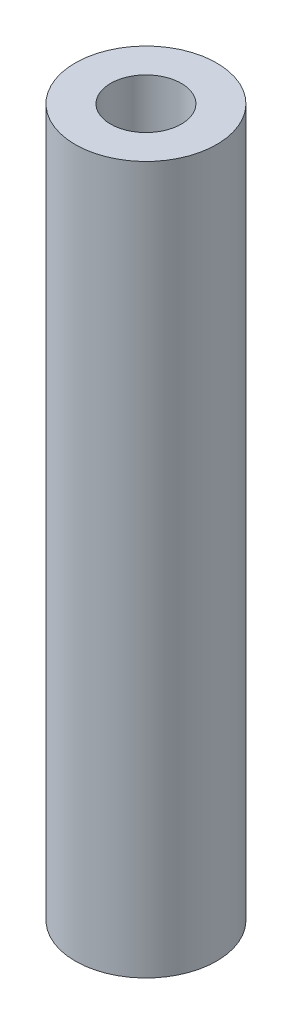
ISO-10303-21;
HEADER;
FILE_DESCRIPTION(('STEP AP214'),'2;1');
FILE_NAME('part.step','',(''),(''),'','','');
FILE_SCHEMA(('AUTOMOTIVE_DESIGN { 1 0 10303 214 1 1 1 1 }'));
ENDSEC;
DATA;
#1=APPLICATION_CONTEXT('core data for automotive mechanical design processes');
#2=APPLICATION_PROTOCOL_DEFINITION('international standard','automotive_design',2000,#1);
#3=PRODUCT_CONTEXT('',#1,'mechanical');
#4=PRODUCT('Part','Part','',(#3));
#5=PRODUCT_RELATED_PRODUCT_CATEGORY('part','',(#4));
#6=PRODUCT_DEFINITION_FORMATION('','',#4);
#7=PRODUCT_DEFINITION_CONTEXT('part definition',#1,'design');
#8=PRODUCT_DEFINITION('design','',#6,#7);
#9=PRODUCT_DEFINITION_SHAPE('','',#8);
#10=(LENGTH_UNIT() NAMED_UNIT(*) SI_UNIT(.MILLI.,.METRE.));
#11=(NAMED_UNIT(*) PLANE_ANGLE_UNIT() SI_UNIT($,.RADIAN.));
#12=(NAMED_UNIT(*) SI_UNIT($,.STERADIAN.) SOLID_ANGLE_UNIT());
#13=UNCERTAINTY_MEASURE_WITH_UNIT(LENGTH_MEASURE(1.E-05),#10,'distance_accuracy_value','');
#14=(GEOMETRIC_REPRESENTATION_CONTEXT(3) GLOBAL_UNCERTAINTY_ASSIGNED_CONTEXT((#13)) GLOBAL_UNIT_ASSIGNED_CONTEXT((#10,
#11,#12)) REPRESENTATION_CONTEXT('',''));
#15=CARTESIAN_POINT('',(0.,0.,0.));
#16=DIRECTION('',(0.,0.,1.));
#17=DIRECTION('',(1.,0.,0.));
#18=AXIS2_PLACEMENT_3D('',#15,#16,#17);
#19=CARTESIAN_POINT('',(0.,31.75,0.));
#20=DIRECTION('',(0.,1.,0.));
#21=DIRECTION('',(0.,0.,1.));
#22=AXIS2_PLACEMENT_3D('',#19,#20,#21);
#23=PLANE('',#22);
#24=CARTESIAN_POINT('',(0.,31.75,0.));
#25=DIRECTION('',(0.,1.,0.));
#26=DIRECTION('',(0.,0.,1.));
#27=AXIS2_PLACEMENT_3D('',#24,#25,#26);
#28=CIRCLE('',#27,3.175);
#29=CARTESIAN_POINT('',(0.,31.75,3.175));
#30=VERTEX_POINT('',#29);
#31=EDGE_CURVE('E10',#30,#30,#28,.T.);
#32=ORIENTED_EDGE('',*,*,#31,.T.);
#33=EDGE_LOOP('',(#32));
#34=FACE_BOUND('',#33,.T.);
#35=CARTESIAN_POINT('',(0.,31.75,0.));
#36=DIRECTION('',(0.,1.,0.));
#37=DIRECTION('',(0.,0.,1.));
#38=AXIS2_PLACEMENT_3D('',#35,#36,#37);
#39=CIRCLE('',#38,1.5875);
#40=CARTESIAN_POINT('',(0.,31.75,1.5875));
#41=VERTEX_POINT('',#40);
#42=EDGE_CURVE('E42',#41,#41,#39,.T.);
#43=ORIENTED_EDGE('',*,*,#42,.F.);
#44=EDGE_LOOP('',(#43));
#45=FACE_BOUND('',#44,.T.);
#46=ADVANCED_FACE('F31',(#34,#45),#23,.T.);
#47=CARTESIAN_POINT('',(0.,0.,0.));
#48=DIRECTION('',(0.,1.,0.));
#49=DIRECTION('',(0.,0.,1.));
#50=AXIS2_PLACEMENT_3D('',#47,#48,#49);
#51=PLANE('',#50);
#52=CARTESIAN_POINT('',(0.,0.,0.));
#53=DIRECTION('',(0.,1.,0.));
#54=DIRECTION('',(0.,0.,1.));
#55=AXIS2_PLACEMENT_3D('',#52,#53,#54);
#56=CIRCLE('',#55,3.175);
#57=CARTESIAN_POINT('',(0.,0.,3.175));
#58=VERTEX_POINT('',#57);
#59=EDGE_CURVE('E35',#58,#58,#56,.T.);
#60=ORIENTED_EDGE('',*,*,#59,.F.);
#61=EDGE_LOOP('',(#60));
#62=FACE_BOUND('',#61,.T.);
#63=CARTESIAN_POINT('',(0.,0.,0.));
#64=DIRECTION('',(0.,1.,0.));
#65=DIRECTION('',(0.,0.,1.));
#66=AXIS2_PLACEMENT_3D('',#63,#64,#65);
#67=CIRCLE('',#66,1.5875);
#68=CARTESIAN_POINT('',(0.,0.,1.5875));
#69=VERTEX_POINT('',#68);
#70=EDGE_CURVE('E44',#69,#69,#67,.T.);
#71=ORIENTED_EDGE('',*,*,#70,.T.);
#72=EDGE_LOOP('',(#71));
#73=FACE_BOUND('',#72,.T.);
#74=ADVANCED_FACE('F54',(#62,#73),#51,.F.);
#75=CARTESIAN_POINT('',(0.,31.75,0.));
#76=DIRECTION('',(0.,-1.,0.));
#77=DIRECTION('',(0.,0.,-1.));
#78=AXIS2_PLACEMENT_3D('',#75,#76,#77);
#79=CYLINDRICAL_SURFACE('',#78,3.175);
#80=ORIENTED_EDGE('',*,*,#31,.F.);
#81=EDGE_LOOP('',(#80));
#82=FACE_BOUND('',#81,.T.);
#83=ORIENTED_EDGE('',*,*,#59,.T.);
#84=EDGE_LOOP('',(#83));
#85=FACE_BOUND('',#84,.T.);
#86=ADVANCED_FACE('F33',(#82,#85),#79,.T.);
#87=CARTESIAN_POINT('',(0.,31.75,0.));
#88=DIRECTION('',(0.,-1.,0.));
#89=DIRECTION('',(0.,0.,-1.));
#90=AXIS2_PLACEMENT_3D('',#87,#88,#89);
#91=CYLINDRICAL_SURFACE('',#90,1.5875);
#92=ORIENTED_EDGE('',*,*,#42,.T.);
#93=EDGE_LOOP('',(#92));
#94=FACE_BOUND('',#93,.T.);
#95=ORIENTED_EDGE('',*,*,#70,.F.);
#96=EDGE_LOOP('',(#95));
#97=FACE_BOUND('',#96,.T.);
#98=ADVANCED_FACE('F50',(#94,#97),#91,.F.);
#99=CLOSED_SHELL('',(#46,#74,#86,#98));
#100=MANIFOLD_SOLID_BREP('B2',#99);
#101=ADVANCED_BREP_SHAPE_REPRESENTATION('',(#18,#100),#14);
#102=SHAPE_DEFINITION_REPRESENTATION(#9,#101);
ENDSEC;
END-ISO-10303-21;
